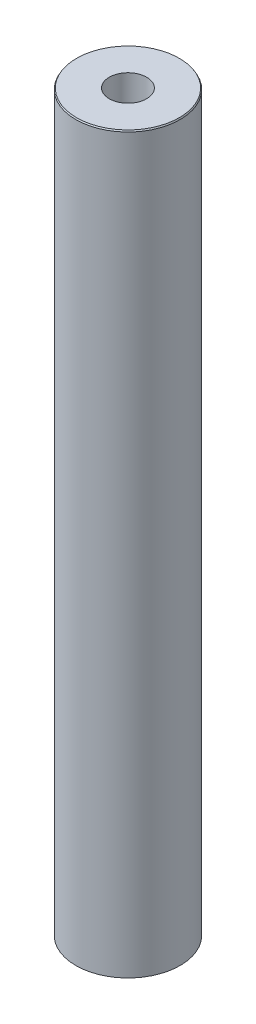
ISO-10303-21;
HEADER;
FILE_DESCRIPTION(('STEP AP214'),'2;1');
FILE_NAME('part.step','',(''),(''),'','','');
FILE_SCHEMA(('AUTOMOTIVE_DESIGN { 1 0 10303 214 1 1 1 1 }'));
ENDSEC;
DATA;
#1=APPLICATION_CONTEXT('core data for automotive mechanical design processes');
#2=APPLICATION_PROTOCOL_DEFINITION('international standard','automotive_design',2000,#1);
#3=PRODUCT_CONTEXT('',#1,'mechanical');
#4=PRODUCT('Part','Part','',(#3));
#5=PRODUCT_RELATED_PRODUCT_CATEGORY('part','',(#4));
#6=PRODUCT_DEFINITION_FORMATION('','',#4);
#7=PRODUCT_DEFINITION_CONTEXT('part definition',#1,'design');
#8=PRODUCT_DEFINITION('design','',#6,#7);
#9=PRODUCT_DEFINITION_SHAPE('','',#8);
#10=(LENGTH_UNIT() NAMED_UNIT(*) SI_UNIT(.MILLI.,.METRE.));
#11=(NAMED_UNIT(*) PLANE_ANGLE_UNIT() SI_UNIT($,.RADIAN.));
#12=(NAMED_UNIT(*) SI_UNIT($,.STERADIAN.) SOLID_ANGLE_UNIT());
#13=UNCERTAINTY_MEASURE_WITH_UNIT(LENGTH_MEASURE(1.E-05),#10,'distance_accuracy_value','');
#14=(GEOMETRIC_REPRESENTATION_CONTEXT(3) GLOBAL_UNCERTAINTY_ASSIGNED_CONTEXT((#13)) GLOBAL_UNIT_ASSIGNED_CONTEXT((#10,
#11,#12)) REPRESENTATION_CONTEXT('',''));
#15=CARTESIAN_POINT('',(0.,0.,0.));
#16=DIRECTION('',(0.,0.,1.));
#17=DIRECTION('',(1.,0.,0.));
#18=AXIS2_PLACEMENT_3D('',#15,#16,#17);
#19=CARTESIAN_POINT('',(0.,598.62996130181,0.));
#20=DIRECTION('',(0.,-1.,0.));
#21=DIRECTION('',(0.,0.,-1.));
#22=AXIS2_PLACEMENT_3D('',#19,#20,#21);
#23=CYLINDRICAL_SURFACE('',#22,42.5);
#24=CARTESIAN_POINT('',(0.,597.577930946675,0.));
#25=DIRECTION('',(0.,1.,0.));
#26=DIRECTION('',(0.,0.,1.));
#27=AXIS2_PLACEMENT_3D('',#24,#25,#26);
#28=CIRCLE('',#27,42.5);
#29=CARTESIAN_POINT('',(0.,597.577930946675,42.5));
#30=VERTEX_POINT('',#29);
#31=EDGE_CURVE('E50',#30,#30,#28,.F.);
#32=ORIENTED_EDGE('',*,*,#31,.T.);
#33=EDGE_LOOP('',(#32));
#34=FACE_BOUND('',#33,.T.);
#35=CARTESIAN_POINT('',(0.,0.607390008732556,0.));
#36=DIRECTION('',(0.,1.,0.));
#37=DIRECTION('',(0.,0.,1.));
#38=AXIS2_PLACEMENT_3D('',#35,#36,#37);
#39=CIRCLE('',#38,42.5);
#40=CARTESIAN_POINT('',(0.,0.607390008732556,42.5));
#41=VERTEX_POINT('',#40);
#42=EDGE_CURVE('E51',#41,#41,#39,.T.);
#43=ORIENTED_EDGE('',*,*,#42,.T.);
#44=EDGE_LOOP('',(#43));
#45=FACE_BOUND('',#44,.T.);
#46=ADVANCED_FACE('F39',(#34,#45),#23,.T.);
#47=CARTESIAN_POINT('',(0.,598.62996130181,0.));
#48=DIRECTION('',(0.,1.,0.));
#49=DIRECTION('',(0.,0.,1.));
#50=AXIS2_PLACEMENT_3D('',#47,#48,#49);
#51=PLANE('',#50);
#52=CARTESIAN_POINT('',(0.,598.62996130181,0.));
#53=DIRECTION('',(0.,1.,0.));
#54=DIRECTION('',(0.,0.,1.));
#55=AXIS2_PLACEMENT_3D('',#52,#53,#54);
#56=CIRCLE('',#55,41.8926099912676);
#57=CARTESIAN_POINT('',(0.,598.62996130181,41.8926099912676));
#58=VERTEX_POINT('',#57);
#59=EDGE_CURVE('E54',#58,#58,#56,.T.);
#60=ORIENTED_EDGE('',*,*,#59,.T.);
#61=EDGE_LOOP('',(#60));
#62=FACE_BOUND('',#61,.T.);
#63=CARTESIAN_POINT('',(0.,598.62996130181,0.));
#64=DIRECTION('',(0.,1.,0.));
#65=DIRECTION('',(0.,0.,1.));
#66=AXIS2_PLACEMENT_3D('',#63,#64,#65);
#67=CIRCLE('',#66,15.2415062660447);
#68=CARTESIAN_POINT('',(0.,598.62996130181,15.2415062660447));
#69=VERTEX_POINT('',#68);
#70=EDGE_CURVE('E58',#69,#69,#67,.T.);
#71=ORIENTED_EDGE('',*,*,#70,.F.);
#72=EDGE_LOOP('',(#71));
#73=FACE_BOUND('',#72,.T.);
#74=ADVANCED_FACE('F69',(#62,#73),#51,.T.);
#75=CARTESIAN_POINT('',(0.,0.,0.));
#76=DIRECTION('',(0.,1.,0.));
#77=DIRECTION('',(0.,0.,1.));
#78=AXIS2_PLACEMENT_3D('',#75,#76,#77);
#79=PLANE('',#78);
#80=CARTESIAN_POINT('',(0.,0.,0.));
#81=DIRECTION('',(0.,1.,0.));
#82=DIRECTION('',(0.,0.,1.));
#83=AXIS2_PLACEMENT_3D('',#80,#81,#82);
#84=CIRCLE('',#83,41.4479696448655);
#85=CARTESIAN_POINT('',(0.,0.,41.4479696448655));
#86=VERTEX_POINT('',#85);
#87=EDGE_CURVE('E10',#86,#86,#84,.F.);
#88=ORIENTED_EDGE('',*,*,#87,.T.);
#89=EDGE_LOOP('',(#88));
#90=FACE_BOUND('',#89,.T.);
#91=CARTESIAN_POINT('',(0.,0.,0.));
#92=DIRECTION('',(0.,1.,0.));
#93=DIRECTION('',(0.,0.,1.));
#94=AXIS2_PLACEMENT_3D('',#91,#92,#93);
#95=CIRCLE('',#94,15.2415062660447);
#96=CARTESIAN_POINT('',(0.,0.,15.2415062660447));
#97=VERTEX_POINT('',#96);
#98=EDGE_CURVE('E63',#97,#97,#95,.T.);
#99=ORIENTED_EDGE('',*,*,#98,.T.);
#100=EDGE_LOOP('',(#99));
#101=FACE_BOUND('',#100,.T.);
#102=ADVANCED_FACE('F75',(#90,#101),#79,.F.);
#103=CARTESIAN_POINT('',(0.,598.62996130181,0.));
#104=DIRECTION('',(0.,-1.,0.));
#105=DIRECTION('',(0.,0.,-1.));
#106=AXIS2_PLACEMENT_3D('',#103,#104,#105);
#107=CYLINDRICAL_SURFACE('',#106,15.2415062660447);
#108=ORIENTED_EDGE('',*,*,#70,.T.);
#109=EDGE_LOOP('',(#108));
#110=FACE_BOUND('',#109,.T.);
#111=ORIENTED_EDGE('',*,*,#98,.F.);
#112=EDGE_LOOP('',(#111));
#113=FACE_BOUND('',#112,.T.);
#114=ADVANCED_FACE('F70',(#110,#113),#107,.F.);
#115=CARTESIAN_POINT('',(0.,598.62996130181,0.));
#116=DIRECTION('',(0.,-1.,0.));
#117=DIRECTION('',(0.,0.,-1.));
#118=AXIS2_PLACEMENT_3D('',#115,#116,#117);
#119=CONICAL_SURFACE('',#118,41.8926099912676,0.523598775598304);
#120=ORIENTED_EDGE('',*,*,#31,.F.);
#121=EDGE_LOOP('',(#120));
#122=FACE_BOUND('',#121,.T.);
#123=ORIENTED_EDGE('',*,*,#59,.F.);
#124=EDGE_LOOP('',(#123));
#125=FACE_BOUND('',#124,.T.);
#126=ADVANCED_FACE('F81',(#122,#125),#119,.T.);
#127=CARTESIAN_POINT('',(0.,0.607390008732556,0.));
#128=DIRECTION('',(0.,1.,0.));
#129=DIRECTION('',(0.,0.,1.));
#130=AXIS2_PLACEMENT_3D('',#127,#128,#129);
#131=CONICAL_SURFACE('',#130,42.5,1.0471975511966);
#132=ORIENTED_EDGE('',*,*,#87,.F.);
#133=EDGE_LOOP('',(#132));
#134=FACE_BOUND('',#133,.T.);
#135=ORIENTED_EDGE('',*,*,#42,.F.);
#136=EDGE_LOOP('',(#135));
#137=FACE_BOUND('',#136,.T.);
#138=ADVANCED_FACE('F45',(#134,#137),#131,.T.);
#139=CLOSED_SHELL('',(#46,#74,#102,#114,#126,#138));
#140=MANIFOLD_SOLID_BREP('B2',#139);
#141=ADVANCED_BREP_SHAPE_REPRESENTATION('',(#18,#140),#14);
#142=SHAPE_DEFINITION_REPRESENTATION(#9,#141);
ENDSEC;
END-ISO-10303-21;
